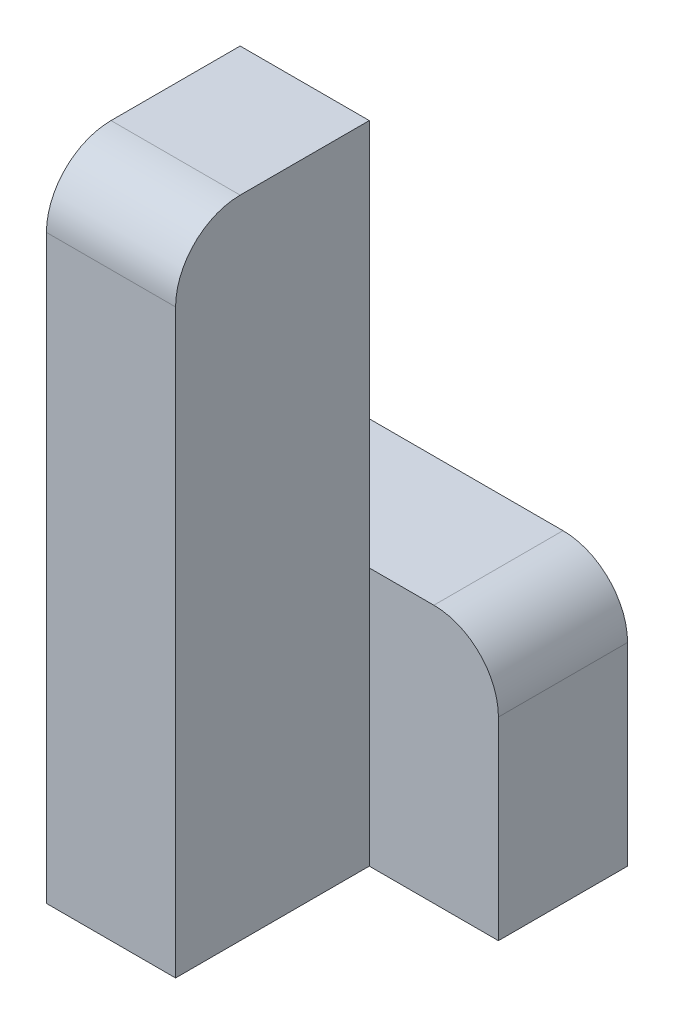
ISO-10303-21;
HEADER;
FILE_DESCRIPTION(('STEP AP214'),'2;1');
FILE_NAME('part.step','',(''),(''),'','','');
FILE_SCHEMA(('AUTOMOTIVE_DESIGN { 1 0 10303 214 1 1 1 1 }'));
ENDSEC;
DATA;
#1=APPLICATION_CONTEXT('core data for automotive mechanical design processes');
#2=APPLICATION_PROTOCOL_DEFINITION('international standard','automotive_design',2000,#1);
#3=PRODUCT_CONTEXT('',#1,'mechanical');
#4=PRODUCT('Part','Part','',(#3));
#5=PRODUCT_RELATED_PRODUCT_CATEGORY('part','',(#4));
#6=PRODUCT_DEFINITION_FORMATION('','',#4);
#7=PRODUCT_DEFINITION_CONTEXT('part definition',#1,'design');
#8=PRODUCT_DEFINITION('design','',#6,#7);
#9=PRODUCT_DEFINITION_SHAPE('','',#8);
#10=(LENGTH_UNIT() NAMED_UNIT(*) SI_UNIT(.MILLI.,.METRE.));
#11=(NAMED_UNIT(*) PLANE_ANGLE_UNIT() SI_UNIT($,.RADIAN.));
#12=(NAMED_UNIT(*) SI_UNIT($,.STERADIAN.) SOLID_ANGLE_UNIT());
#13=UNCERTAINTY_MEASURE_WITH_UNIT(LENGTH_MEASURE(1.E-05),#10,'distance_accuracy_value','');
#14=(GEOMETRIC_REPRESENTATION_CONTEXT(3) GLOBAL_UNCERTAINTY_ASSIGNED_CONTEXT((#13)) GLOBAL_UNIT_ASSIGNED_CONTEXT((#10,
#11,#12)) REPRESENTATION_CONTEXT('',''));
#15=CARTESIAN_POINT('',(0.,0.,0.));
#16=DIRECTION('',(0.,0.,1.));
#17=DIRECTION('',(1.,0.,0.));
#18=AXIS2_PLACEMENT_3D('',#15,#16,#17);
#19=CARTESIAN_POINT('',(-10.,0.,30.));
#20=DIRECTION('',(0.,-1.,0.));
#21=DIRECTION('',(1.,0.,0.));
#22=AXIS2_PLACEMENT_3D('',#19,#20,#21);
#23=PLANE('',#22);
#24=DIRECTION('',(0.,0.,-1.));
#25=VECTOR('',#24,1.);
#26=CARTESIAN_POINT('',(-30.,0.,30.));
#27=LINE('',#26,#25);
#28=CARTESIAN_POINT('',(-30.,0.,20.));
#29=VERTEX_POINT('',#28);
#30=CARTESIAN_POINT('',(-30.,0.,0.));
#31=VERTEX_POINT('',#30);
#32=EDGE_CURVE('E171',#29,#31,#27,.T.);
#33=ORIENTED_EDGE('',*,*,#32,.F.);
#34=DIRECTION('',(-1.,0.,0.));
#35=VECTOR('',#34,1.);
#36=CARTESIAN_POINT('',(-10.,0.,20.));
#37=LINE('',#36,#35);
#38=CARTESIAN_POINT('',(-10.,0.,20.));
#39=VERTEX_POINT('',#38);
#40=EDGE_CURVE('E43',#29,#39,#37,.F.);
#41=ORIENTED_EDGE('',*,*,#40,.T.);
#42=DIRECTION('',(0.,0.,-1.));
#43=VECTOR('',#42,1.);
#44=CARTESIAN_POINT('',(-10.,0.,30.));
#45=LINE('',#44,#43);
#46=CARTESIAN_POINT('',(-10.,0.,0.));
#47=VERTEX_POINT('',#46);
#48=EDGE_CURVE('E158',#39,#47,#45,.T.);
#49=ORIENTED_EDGE('',*,*,#48,.T.);
#50=DIRECTION('',(-1.,0.,0.));
#51=VECTOR('',#50,1.);
#52=CARTESIAN_POINT('',(-10.,0.,0.));
#53=LINE('',#52,#51);
#54=EDGE_CURVE('E148',#47,#31,#53,.T.);
#55=ORIENTED_EDGE('',*,*,#54,.T.);
#56=EDGE_LOOP('',(#33,#41,#49,#55));
#57=FACE_BOUND('',#56,.T.);
#58=ADVANCED_FACE('F35',(#57),#23,.F.);
#59=CARTESIAN_POINT('',(-30.,0.,30.));
#60=DIRECTION('',(1.,0.,0.));
#61=DIRECTION('',(0.,0.,-1.));
#62=AXIS2_PLACEMENT_3D('',#59,#60,#61);
#63=PLANE('',#62);
#64=DIRECTION('',(0.,-1.,0.));
#65=VECTOR('',#64,1.);
#66=CARTESIAN_POINT('',(-30.,0.,30.));
#67=LINE('',#66,#65);
#68=CARTESIAN_POINT('',(-30.,-10.,30.));
#69=VERTEX_POINT('',#68);
#70=CARTESIAN_POINT('',(-30.,-100.,30.));
#71=VERTEX_POINT('',#70);
#72=EDGE_CURVE('E150',#69,#71,#67,.T.);
#73=ORIENTED_EDGE('',*,*,#72,.F.);
#74=CARTESIAN_POINT('',(-30.,-10.,20.));
#75=DIRECTION('',(1.,0.,0.));
#76=DIRECTION('',(0.,0.,-1.));
#77=AXIS2_PLACEMENT_3D('',#74,#75,#76);
#78=CIRCLE('',#77,10.);
#79=EDGE_CURVE('E57',#69,#29,#78,.F.);
#80=ORIENTED_EDGE('',*,*,#79,.T.);
#81=ORIENTED_EDGE('',*,*,#32,.T.);
#82=DIRECTION('',(0.,-1.,0.));
#83=VECTOR('',#82,1.);
#84=CARTESIAN_POINT('',(-30.,0.,0.));
#85=LINE('',#84,#83);
#86=CARTESIAN_POINT('',(-30.,-60.,0.));
#87=VERTEX_POINT('',#86);
#88=EDGE_CURVE('E126',#31,#87,#85,.T.);
#89=ORIENTED_EDGE('',*,*,#88,.T.);
#90=DIRECTION('',(0.,0.,1.));
#91=VECTOR('',#90,1.);
#92=CARTESIAN_POINT('',(-30.,-60.,-20.));
#93=LINE('',#92,#91);
#94=CARTESIAN_POINT('',(-30.,-60.,-20.));
#95=VERTEX_POINT('',#94);
#96=EDGE_CURVE('E111',#95,#87,#93,.T.);
#97=ORIENTED_EDGE('',*,*,#96,.F.);
#98=DIRECTION('',(0.,-1.,0.));
#99=VECTOR('',#98,1.);
#100=CARTESIAN_POINT('',(-30.,-60.,-20.));
#101=LINE('',#100,#99);
#102=CARTESIAN_POINT('',(-30.,-100.,-20.));
#103=VERTEX_POINT('',#102);
#104=EDGE_CURVE('E118',#95,#103,#101,.T.);
#105=ORIENTED_EDGE('',*,*,#104,.T.);
#106=DIRECTION('',(0.,0.,-1.));
#107=VECTOR('',#106,1.);
#108=CARTESIAN_POINT('',(-30.,-100.,30.));
#109=LINE('',#108,#107);
#110=EDGE_CURVE('E169',#71,#103,#109,.T.);
#111=ORIENTED_EDGE('',*,*,#110,.F.);
#112=EDGE_LOOP('',(#73,#80,#81,#89,#97,#105,#111));
#113=FACE_BOUND('',#112,.T.);
#114=ADVANCED_FACE('F123',(#113),#63,.F.);
#115=CARTESIAN_POINT('',(-30.,-100.,30.));
#116=DIRECTION('',(0.,1.,0.));
#117=DIRECTION('',(0.,0.,1.));
#118=AXIS2_PLACEMENT_3D('',#115,#116,#117);
#119=PLANE('',#118);
#120=ORIENTED_EDGE('',*,*,#110,.T.);
#121=DIRECTION('',(1.,0.,0.));
#122=VECTOR('',#121,1.);
#123=CARTESIAN_POINT('',(-30.,-100.,-20.));
#124=LINE('',#123,#122);
#125=CARTESIAN_POINT('',(10.,-100.,-20.));
#126=VERTEX_POINT('',#125);
#127=EDGE_CURVE('E134',#103,#126,#124,.T.);
#128=ORIENTED_EDGE('',*,*,#127,.T.);
#129=DIRECTION('',(0.,0.,1.));
#130=VECTOR('',#129,1.);
#131=CARTESIAN_POINT('',(10.,-100.,-20.));
#132=LINE('',#131,#130);
#133=CARTESIAN_POINT('',(10.,-100.,0.));
#134=VERTEX_POINT('',#133);
#135=EDGE_CURVE('E127',#126,#134,#132,.T.);
#136=ORIENTED_EDGE('',*,*,#135,.T.);
#137=DIRECTION('',(1.,0.,0.));
#138=VECTOR('',#137,1.);
#139=CARTESIAN_POINT('',(-30.,-100.,0.));
#140=LINE('',#139,#138);
#141=CARTESIAN_POINT('',(-10.,-100.,0.));
#142=VERTEX_POINT('',#141);
#143=EDGE_CURVE('E142',#142,#134,#140,.T.);
#144=ORIENTED_EDGE('',*,*,#143,.F.);
#145=DIRECTION('',(0.,0.,-1.));
#146=VECTOR('',#145,1.);
#147=CARTESIAN_POINT('',(-10.,-100.,30.));
#148=LINE('',#147,#146);
#149=CARTESIAN_POINT('',(-10.,-100.,30.));
#150=VERTEX_POINT('',#149);
#151=EDGE_CURVE('E166',#150,#142,#148,.T.);
#152=ORIENTED_EDGE('',*,*,#151,.F.);
#153=DIRECTION('',(1.,0.,0.));
#154=VECTOR('',#153,1.);
#155=CARTESIAN_POINT('',(-30.,-100.,30.));
#156=LINE('',#155,#154);
#157=EDGE_CURVE('E152',#71,#150,#156,.T.);
#158=ORIENTED_EDGE('',*,*,#157,.F.);
#159=EDGE_LOOP('',(#120,#128,#136,#144,#152,#158));
#160=FACE_BOUND('',#159,.T.);
#161=ADVANCED_FACE('F193',(#160),#119,.F.);
#162=CARTESIAN_POINT('',(-10.,-100.,30.));
#163=DIRECTION('',(-1.,0.,0.));
#164=DIRECTION('',(0.,0.,1.));
#165=AXIS2_PLACEMENT_3D('',#162,#163,#164);
#166=PLANE('',#165);
#167=ORIENTED_EDGE('',*,*,#48,.F.);
#168=CARTESIAN_POINT('',(-10.,-10.,20.));
#169=DIRECTION('',(-1.,0.,0.));
#170=DIRECTION('',(0.,0.,1.));
#171=AXIS2_PLACEMENT_3D('',#168,#169,#170);
#172=CIRCLE('',#171,10.);
#173=CARTESIAN_POINT('',(-10.,-9.99999999999999,30.));
#174=VERTEX_POINT('',#173);
#175=EDGE_CURVE('E11',#39,#174,#172,.F.);
#176=ORIENTED_EDGE('',*,*,#175,.T.);
#177=DIRECTION('',(0.,1.,0.));
#178=VECTOR('',#177,1.);
#179=CARTESIAN_POINT('',(-10.,-100.,30.));
#180=LINE('',#179,#178);
#181=EDGE_CURVE('E155',#150,#174,#180,.T.);
#182=ORIENTED_EDGE('',*,*,#181,.F.);
#183=ORIENTED_EDGE('',*,*,#151,.T.);
#184=DIRECTION('',(0.,1.,0.));
#185=VECTOR('',#184,1.);
#186=CARTESIAN_POINT('',(-10.,-100.,0.));
#187=LINE('',#186,#185);
#188=CARTESIAN_POINT('',(-10.,-60.,0.));
#189=VERTEX_POINT('',#188);
#190=EDGE_CURVE('E153',#142,#189,#187,.T.);
#191=ORIENTED_EDGE('',*,*,#190,.T.);
#192=EDGE_CURVE('E162',#189,#47,#187,.T.);
#193=ORIENTED_EDGE('',*,*,#192,.T.);
#194=EDGE_LOOP('',(#167,#176,#182,#183,#191,#193));
#195=FACE_BOUND('',#194,.T.);
#196=ADVANCED_FACE('F196',(#195),#166,.F.);
#197=CARTESIAN_POINT('',(0.,0.,30.));
#198=DIRECTION('',(0.,0.,1.));
#199=DIRECTION('',(1.,0.,0.));
#200=AXIS2_PLACEMENT_3D('',#197,#198,#199);
#201=PLANE('',#200);
#202=ORIENTED_EDGE('',*,*,#181,.T.);
#203=DIRECTION('',(-1.,0.,0.));
#204=VECTOR('',#203,1.);
#205=CARTESIAN_POINT('',(-30.,-10.,30.));
#206=LINE('',#205,#204);
#207=EDGE_CURVE('E181',#174,#69,#206,.T.);
#208=ORIENTED_EDGE('',*,*,#207,.T.);
#209=ORIENTED_EDGE('',*,*,#72,.T.);
#210=ORIENTED_EDGE('',*,*,#157,.T.);
#211=EDGE_LOOP('',(#202,#208,#209,#210));
#212=FACE_BOUND('',#211,.T.);
#213=ADVANCED_FACE('F186',(#212),#201,.T.);
#214=CARTESIAN_POINT('',(0.,0.,0.));
#215=DIRECTION('',(0.,0.,1.));
#216=DIRECTION('',(1.,0.,0.));
#217=AXIS2_PLACEMENT_3D('',#214,#215,#216);
#218=PLANE('',#217);
#219=ORIENTED_EDGE('',*,*,#192,.F.);
#220=DIRECTION('',(-1.,0.,0.));
#221=VECTOR('',#220,1.);
#222=CARTESIAN_POINT('',(10.,-60.,0.));
#223=LINE('',#222,#221);
#224=EDGE_CURVE('E143',#189,#87,#223,.T.);
#225=ORIENTED_EDGE('',*,*,#224,.T.);
#226=ORIENTED_EDGE('',*,*,#88,.F.);
#227=ORIENTED_EDGE('',*,*,#54,.F.);
#228=EDGE_LOOP('',(#219,#225,#226,#227));
#229=FACE_BOUND('',#228,.T.);
#230=ADVANCED_FACE('F215',(#229),#218,.F.);
#231=CARTESIAN_POINT('',(0.,0.,0.));
#232=DIRECTION('',(0.,0.,1.));
#233=DIRECTION('',(1.,0.,0.));
#234=AXIS2_PLACEMENT_3D('',#231,#232,#233);
#235=PLANE('',#234);
#236=DIRECTION('',(0.,1.,0.));
#237=VECTOR('',#236,1.);
#238=CARTESIAN_POINT('',(10.,-100.,0.));
#239=LINE('',#238,#237);
#240=CARTESIAN_POINT('',(10.,-70.,0.));
#241=VERTEX_POINT('',#240);
#242=EDGE_CURVE('E119',#134,#241,#239,.T.);
#243=ORIENTED_EDGE('',*,*,#242,.T.);
#244=CARTESIAN_POINT('',(0.,-70.,0.));
#245=DIRECTION('',(0.,0.,1.));
#246=DIRECTION('',(1.,0.,0.));
#247=AXIS2_PLACEMENT_3D('',#244,#245,#246);
#248=CIRCLE('',#247,10.);
#249=CARTESIAN_POINT('',(0.,-60.,0.));
#250=VERTEX_POINT('',#249);
#251=EDGE_CURVE('E176',#241,#250,#248,.T.);
#252=ORIENTED_EDGE('',*,*,#251,.T.);
#253=EDGE_CURVE('E140',#250,#189,#223,.T.);
#254=ORIENTED_EDGE('',*,*,#253,.T.);
#255=ORIENTED_EDGE('',*,*,#190,.F.);
#256=ORIENTED_EDGE('',*,*,#143,.T.);
#257=EDGE_LOOP('',(#243,#252,#254,#255,#256));
#258=FACE_BOUND('',#257,.T.);
#259=ADVANCED_FACE('F218',(#258),#235,.T.);
#260=CARTESIAN_POINT('',(10.,-60.,-20.));
#261=DIRECTION('',(0.,1.,0.));
#262=DIRECTION('',(-1.,0.,0.));
#263=AXIS2_PLACEMENT_3D('',#260,#261,#262);
#264=PLANE('',#263);
#265=ORIENTED_EDGE('',*,*,#253,.F.);
#266=DIRECTION('',(0.,0.,1.));
#267=VECTOR('',#266,1.);
#268=CARTESIAN_POINT('',(0.,-60.,-20.));
#269=LINE('',#268,#267);
#270=CARTESIAN_POINT('',(0.,-60.,-20.));
#271=VERTEX_POINT('',#270);
#272=EDGE_CURVE('E114',#250,#271,#269,.F.);
#273=ORIENTED_EDGE('',*,*,#272,.T.);
#274=DIRECTION('',(-1.,0.,0.));
#275=VECTOR('',#274,1.);
#276=CARTESIAN_POINT('',(10.,-60.,-20.));
#277=LINE('',#276,#275);
#278=EDGE_CURVE('E106',#271,#95,#277,.T.);
#279=ORIENTED_EDGE('',*,*,#278,.T.);
#280=ORIENTED_EDGE('',*,*,#96,.T.);
#281=ORIENTED_EDGE('',*,*,#224,.F.);
#282=EDGE_LOOP('',(#265,#273,#279,#280,#281));
#283=FACE_BOUND('',#282,.T.);
#284=ADVANCED_FACE('F109',(#283),#264,.T.);
#285=CARTESIAN_POINT('',(10.,-100.,-20.));
#286=DIRECTION('',(1.,0.,0.));
#287=DIRECTION('',(0.,0.,-1.));
#288=AXIS2_PLACEMENT_3D('',#285,#286,#287);
#289=PLANE('',#288);
#290=DIRECTION('',(0.,1.,0.));
#291=VECTOR('',#290,1.);
#292=CARTESIAN_POINT('',(10.,-100.,-20.));
#293=LINE('',#292,#291);
#294=CARTESIAN_POINT('',(10.,-70.,-20.));
#295=VERTEX_POINT('',#294);
#296=EDGE_CURVE('E128',#126,#295,#293,.T.);
#297=ORIENTED_EDGE('',*,*,#296,.T.);
#298=DIRECTION('',(0.,0.,1.));
#299=VECTOR('',#298,1.);
#300=CARTESIAN_POINT('',(10.,-70.,-20.));
#301=LINE('',#300,#299);
#302=EDGE_CURVE('E173',#295,#241,#301,.T.);
#303=ORIENTED_EDGE('',*,*,#302,.T.);
#304=ORIENTED_EDGE('',*,*,#242,.F.);
#305=ORIENTED_EDGE('',*,*,#135,.F.);
#306=EDGE_LOOP('',(#297,#303,#304,#305));
#307=FACE_BOUND('',#306,.T.);
#308=ADVANCED_FACE('F224',(#307),#289,.T.);
#309=CARTESIAN_POINT('',(0.,0.,-20.));
#310=DIRECTION('',(0.,0.,1.));
#311=DIRECTION('',(1.,0.,0.));
#312=AXIS2_PLACEMENT_3D('',#309,#310,#311);
#313=PLANE('',#312);
#314=ORIENTED_EDGE('',*,*,#278,.F.);
#315=CARTESIAN_POINT('',(0.,-70.,-20.));
#316=DIRECTION('',(0.,0.,1.));
#317=DIRECTION('',(1.,0.,0.));
#318=AXIS2_PLACEMENT_3D('',#315,#316,#317);
#319=CIRCLE('',#318,10.);
#320=EDGE_CURVE('E179',#271,#295,#319,.F.);
#321=ORIENTED_EDGE('',*,*,#320,.T.);
#322=ORIENTED_EDGE('',*,*,#296,.F.);
#323=ORIENTED_EDGE('',*,*,#127,.F.);
#324=ORIENTED_EDGE('',*,*,#104,.F.);
#325=EDGE_LOOP('',(#314,#321,#322,#323,#324));
#326=FACE_BOUND('',#325,.T.);
#327=ADVANCED_FACE('F131',(#326),#313,.F.);
#328=CARTESIAN_POINT('',(0.,-70.,-20.));
#329=DIRECTION('',(0.,0.,1.));
#330=DIRECTION('',(1.,0.,0.));
#331=AXIS2_PLACEMENT_3D('',#328,#329,#330);
#332=CYLINDRICAL_SURFACE('',#331,10.);
#333=ORIENTED_EDGE('',*,*,#320,.F.);
#334=ORIENTED_EDGE('',*,*,#272,.F.);
#335=ORIENTED_EDGE('',*,*,#251,.F.);
#336=ORIENTED_EDGE('',*,*,#302,.F.);
#337=EDGE_LOOP('',(#333,#334,#335,#336));
#338=FACE_BOUND('',#337,.T.);
#339=ADVANCED_FACE('F199',(#338),#332,.T.);
#340=CARTESIAN_POINT('',(0.,-10.,20.));
#341=DIRECTION('',(1.,0.,0.));
#342=DIRECTION('',(0.,1.,0.));
#343=AXIS2_PLACEMENT_3D('',#340,#341,#342);
#344=CYLINDRICAL_SURFACE('',#343,10.);
#345=ORIENTED_EDGE('',*,*,#175,.F.);
#346=ORIENTED_EDGE('',*,*,#40,.F.);
#347=ORIENTED_EDGE('',*,*,#79,.F.);
#348=ORIENTED_EDGE('',*,*,#207,.F.);
#349=EDGE_LOOP('',(#345,#346,#347,#348));
#350=FACE_BOUND('',#349,.T.);
#351=ADVANCED_FACE('F37',(#350),#344,.T.);
#352=CLOSED_SHELL('',(#58,#114,#161,#196,#213,#230,#259,#284,#308,#327,#339,#351));
#353=MANIFOLD_SOLID_BREP('B2',#352);
#354=ADVANCED_BREP_SHAPE_REPRESENTATION('',(#18,#353),#14);
#355=SHAPE_DEFINITION_REPRESENTATION(#9,#354);
ENDSEC;
END-ISO-10303-21;
